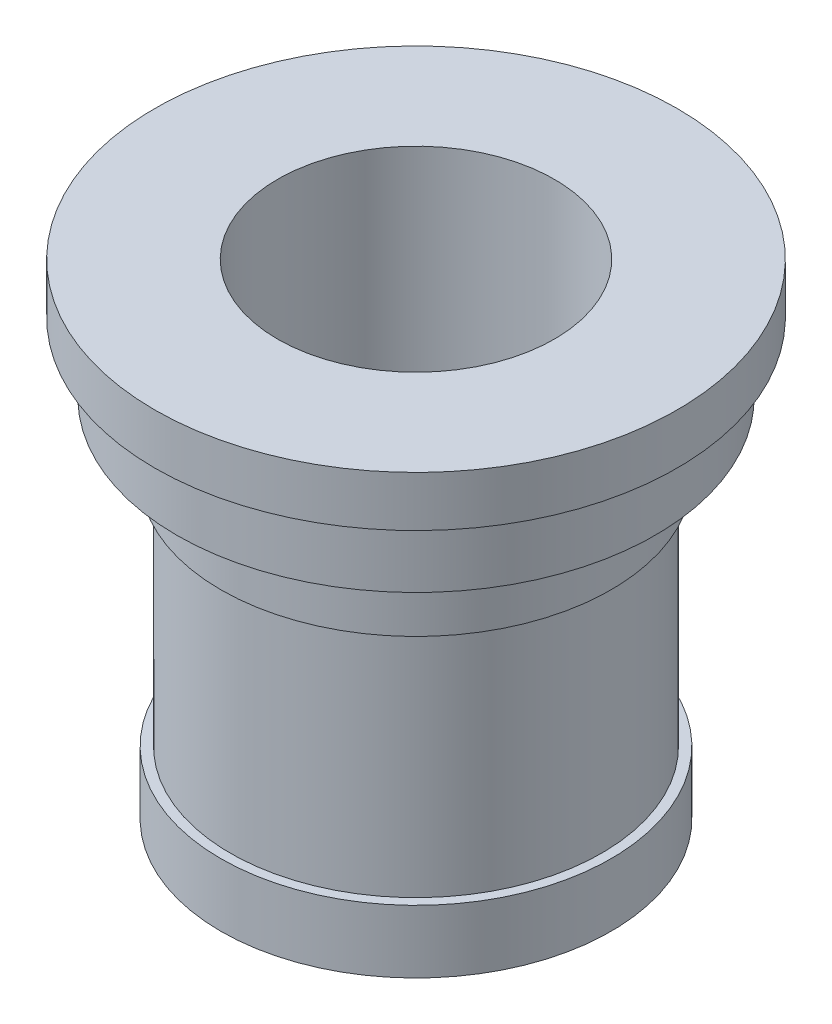
ISO-10303-21;
HEADER;
FILE_DESCRIPTION(('STEP AP214'),'2;1');
FILE_NAME('part.step','',(''),(''),'','','');
FILE_SCHEMA(('AUTOMOTIVE_DESIGN { 1 0 10303 214 1 1 1 1 }'));
ENDSEC;
DATA;
#1=APPLICATION_CONTEXT('core data for automotive mechanical design processes');
#2=APPLICATION_PROTOCOL_DEFINITION('international standard','automotive_design',2000,#1);
#3=PRODUCT_CONTEXT('',#1,'mechanical');
#4=PRODUCT('Part','Part','',(#3));
#5=PRODUCT_RELATED_PRODUCT_CATEGORY('part','',(#4));
#6=PRODUCT_DEFINITION_FORMATION('','',#4);
#7=PRODUCT_DEFINITION_CONTEXT('part definition',#1,'design');
#8=PRODUCT_DEFINITION('design','',#6,#7);
#9=PRODUCT_DEFINITION_SHAPE('','',#8);
#10=(LENGTH_UNIT() NAMED_UNIT(*) SI_UNIT(.MILLI.,.METRE.));
#11=(NAMED_UNIT(*) PLANE_ANGLE_UNIT() SI_UNIT($,.RADIAN.));
#12=(NAMED_UNIT(*) SI_UNIT($,.STERADIAN.) SOLID_ANGLE_UNIT());
#13=UNCERTAINTY_MEASURE_WITH_UNIT(LENGTH_MEASURE(1.E-05),#10,'distance_accuracy_value','');
#14=(GEOMETRIC_REPRESENTATION_CONTEXT(3) GLOBAL_UNCERTAINTY_ASSIGNED_CONTEXT((#13)) GLOBAL_UNIT_ASSIGNED_CONTEXT((#10,
#11,#12)) REPRESENTATION_CONTEXT('',''));
#15=CARTESIAN_POINT('',(0.,0.,0.));
#16=DIRECTION('',(0.,0.,1.));
#17=DIRECTION('',(1.,0.,0.));
#18=AXIS2_PLACEMENT_3D('',#15,#16,#17);
#19=CARTESIAN_POINT('',(0.,0.,0.));
#20=DIRECTION('',(0.,-1.,0.));
#21=DIRECTION('',(0.,0.,-1.));
#22=AXIS2_PLACEMENT_3D('',#19,#20,#21);
#23=PLANE('',#22);
#24=CARTESIAN_POINT('',(0.,0.,0.));
#25=DIRECTION('',(0.,1.,0.));
#26=DIRECTION('',(0.,0.,1.));
#27=AXIS2_PLACEMENT_3D('',#24,#25,#26);
#28=CIRCLE('',#27,22.);
#29=CARTESIAN_POINT('',(0.,0.,22.));
#30=VERTEX_POINT('',#29);
#31=EDGE_CURVE('E68',#30,#30,#28,.T.);
#32=ORIENTED_EDGE('',*,*,#31,.T.);
#33=EDGE_LOOP('',(#32));
#34=FACE_BOUND('',#33,.T.);
#35=CARTESIAN_POINT('',(0.,0.,0.));
#36=DIRECTION('',(0.,-1.,0.));
#37=DIRECTION('',(0.,0.,-1.));
#38=AXIS2_PLACEMENT_3D('',#35,#36,#37);
#39=CIRCLE('',#38,31.);
#40=CARTESIAN_POINT('',(0.,0.,-31.));
#41=VERTEX_POINT('',#40);
#42=EDGE_CURVE('E10',#41,#41,#39,.T.);
#43=ORIENTED_EDGE('',*,*,#42,.T.);
#44=EDGE_LOOP('',(#43));
#45=FACE_BOUND('',#44,.T.);
#46=ADVANCED_FACE('F31',(#34,#45),#23,.T.);
#47=CARTESIAN_POINT('',(0.,0.,0.));
#48=DIRECTION('',(0.,-1.,0.));
#49=DIRECTION('',(0.,0.,-1.));
#50=AXIS2_PLACEMENT_3D('',#47,#48,#49);
#51=CYLINDRICAL_SURFACE('',#50,31.);
#52=CARTESIAN_POINT('',(0.,10.,0.));
#53=DIRECTION('',(0.,-1.,0.));
#54=DIRECTION('',(0.,0.,-1.));
#55=AXIS2_PLACEMENT_3D('',#52,#53,#54);
#56=CIRCLE('',#55,31.);
#57=CARTESIAN_POINT('',(0.,10.,-31.));
#58=VERTEX_POINT('',#57);
#59=EDGE_CURVE('E37',#58,#58,#56,.T.);
#60=ORIENTED_EDGE('',*,*,#59,.T.);
#61=EDGE_LOOP('',(#60));
#62=FACE_BOUND('',#61,.T.);
#63=ORIENTED_EDGE('',*,*,#42,.F.);
#64=EDGE_LOOP('',(#63));
#65=FACE_BOUND('',#64,.T.);
#66=ADVANCED_FACE('F133',(#62,#65),#51,.T.);
#67=CARTESIAN_POINT('',(31.,10.,0.));
#68=DIRECTION('',(0.,1.,0.));
#69=DIRECTION('',(0.,0.,1.));
#70=AXIS2_PLACEMENT_3D('',#67,#68,#69);
#71=PLANE('',#70);
#72=CARTESIAN_POINT('',(0.,10.,0.));
#73=DIRECTION('',(0.,-1.,0.));
#74=DIRECTION('',(0.,0.,-1.));
#75=AXIS2_PLACEMENT_3D('',#72,#73,#74);
#76=CIRCLE('',#75,29.5);
#77=CARTESIAN_POINT('',(0.,10.,-29.5));
#78=VERTEX_POINT('',#77);
#79=EDGE_CURVE('E41',#78,#78,#76,.T.);
#80=ORIENTED_EDGE('',*,*,#79,.T.);
#81=EDGE_LOOP('',(#80));
#82=FACE_BOUND('',#81,.T.);
#83=ORIENTED_EDGE('',*,*,#59,.F.);
#84=EDGE_LOOP('',(#83));
#85=FACE_BOUND('',#84,.T.);
#86=ADVANCED_FACE('F127',(#82,#85),#71,.T.);
#87=CARTESIAN_POINT('',(0.,0.,0.));
#88=DIRECTION('',(0.,-1.,0.));
#89=DIRECTION('',(0.,0.,-1.));
#90=AXIS2_PLACEMENT_3D('',#87,#88,#89);
#91=CYLINDRICAL_SURFACE('',#90,29.5);
#92=CARTESIAN_POINT('',(0.,47.,0.));
#93=DIRECTION('',(0.,-1.,0.));
#94=DIRECTION('',(0.,0.,-1.));
#95=AXIS2_PLACEMENT_3D('',#92,#93,#94);
#96=CIRCLE('',#95,29.5);
#97=CARTESIAN_POINT('',(0.,47.,-29.5));
#98=VERTEX_POINT('',#97);
#99=EDGE_CURVE('E45',#98,#98,#96,.T.);
#100=ORIENTED_EDGE('',*,*,#99,.T.);
#101=EDGE_LOOP('',(#100));
#102=FACE_BOUND('',#101,.T.);
#103=ORIENTED_EDGE('',*,*,#79,.F.);
#104=EDGE_LOOP('',(#103));
#105=FACE_BOUND('',#104,.T.);
#106=ADVANCED_FACE('F121',(#102,#105),#91,.T.);
#107=CARTESIAN_POINT('',(29.5,47.,0.));
#108=DIRECTION('',(0.,-1.,0.));
#109=DIRECTION('',(0.,0.,-1.));
#110=AXIS2_PLACEMENT_3D('',#107,#108,#109);
#111=PLANE('',#110);
#112=CARTESIAN_POINT('',(0.,47.,0.));
#113=DIRECTION('',(0.,-1.,0.));
#114=DIRECTION('',(0.,0.,-1.));
#115=AXIS2_PLACEMENT_3D('',#112,#113,#114);
#116=CIRCLE('',#115,31.);
#117=CARTESIAN_POINT('',(0.,47.,-31.));
#118=VERTEX_POINT('',#117);
#119=EDGE_CURVE('E50',#118,#118,#116,.T.);
#120=ORIENTED_EDGE('',*,*,#119,.T.);
#121=EDGE_LOOP('',(#120));
#122=FACE_BOUND('',#121,.T.);
#123=ORIENTED_EDGE('',*,*,#99,.F.);
#124=EDGE_LOOP('',(#123));
#125=FACE_BOUND('',#124,.T.);
#126=ADVANCED_FACE('F115',(#122,#125),#111,.T.);
#127=CARTESIAN_POINT('',(0.,0.,0.));
#128=DIRECTION('',(0.,-1.,0.));
#129=DIRECTION('',(0.,0.,-1.));
#130=AXIS2_PLACEMENT_3D('',#127,#128,#129);
#131=CYLINDRICAL_SURFACE('',#130,31.);
#132=CARTESIAN_POINT('',(0.,58.,0.));
#133=DIRECTION('',(0.,-1.,0.));
#134=DIRECTION('',(0.,0.,-1.));
#135=AXIS2_PLACEMENT_3D('',#132,#133,#134);
#136=CIRCLE('',#135,31.);
#137=CARTESIAN_POINT('',(0.,58.,-31.));
#138=VERTEX_POINT('',#137);
#139=EDGE_CURVE('E53',#138,#138,#136,.T.);
#140=ORIENTED_EDGE('',*,*,#139,.T.);
#141=EDGE_LOOP('',(#140));
#142=FACE_BOUND('',#141,.T.);
#143=ORIENTED_EDGE('',*,*,#119,.F.);
#144=EDGE_LOOP('',(#143));
#145=FACE_BOUND('',#144,.T.);
#146=ADVANCED_FACE('F109',(#142,#145),#131,.T.);
#147=CARTESIAN_POINT('',(31.,58.,0.));
#148=DIRECTION('',(0.,-1.,0.));
#149=DIRECTION('',(0.,0.,-1.));
#150=AXIS2_PLACEMENT_3D('',#147,#148,#149);
#151=PLANE('',#150);
#152=CARTESIAN_POINT('',(0.,58.,0.));
#153=DIRECTION('',(0.,-1.,0.));
#154=DIRECTION('',(0.,0.,-1.));
#155=AXIS2_PLACEMENT_3D('',#152,#153,#154);
#156=CIRCLE('',#155,38.);
#157=CARTESIAN_POINT('',(0.,58.,-38.));
#158=VERTEX_POINT('',#157);
#159=EDGE_CURVE('E56',#158,#158,#156,.T.);
#160=ORIENTED_EDGE('',*,*,#159,.T.);
#161=EDGE_LOOP('',(#160));
#162=FACE_BOUND('',#161,.T.);
#163=ORIENTED_EDGE('',*,*,#139,.F.);
#164=EDGE_LOOP('',(#163));
#165=FACE_BOUND('',#164,.T.);
#166=ADVANCED_FACE('F103',(#162,#165),#151,.T.);
#167=CARTESIAN_POINT('',(0.,0.,0.));
#168=DIRECTION('',(0.,-1.,0.));
#169=DIRECTION('',(0.,0.,-1.));
#170=AXIS2_PLACEMENT_3D('',#167,#168,#169);
#171=CYLINDRICAL_SURFACE('',#170,38.);
#172=CARTESIAN_POINT('',(0.,69.,0.));
#173=DIRECTION('',(0.,-1.,0.));
#174=DIRECTION('',(0.,0.,-1.));
#175=AXIS2_PLACEMENT_3D('',#172,#173,#174);
#176=CIRCLE('',#175,38.);
#177=CARTESIAN_POINT('',(0.,69.,-38.));
#178=VERTEX_POINT('',#177);
#179=EDGE_CURVE('E59',#178,#178,#176,.T.);
#180=ORIENTED_EDGE('',*,*,#179,.T.);
#181=EDGE_LOOP('',(#180));
#182=FACE_BOUND('',#181,.T.);
#183=ORIENTED_EDGE('',*,*,#159,.F.);
#184=EDGE_LOOP('',(#183));
#185=FACE_BOUND('',#184,.T.);
#186=ADVANCED_FACE('F97',(#182,#185),#171,.T.);
#187=CARTESIAN_POINT('',(38.,69.,0.));
#188=DIRECTION('',(0.,-1.,0.));
#189=DIRECTION('',(0.,0.,-1.));
#190=AXIS2_PLACEMENT_3D('',#187,#188,#189);
#191=PLANE('',#190);
#192=CARTESIAN_POINT('',(0.,69.,0.));
#193=DIRECTION('',(0.,-1.,0.));
#194=DIRECTION('',(0.,0.,-1.));
#195=AXIS2_PLACEMENT_3D('',#192,#193,#194);
#196=CIRCLE('',#195,41.5);
#197=CARTESIAN_POINT('',(0.,69.,-41.5));
#198=VERTEX_POINT('',#197);
#199=EDGE_CURVE('E62',#198,#198,#196,.T.);
#200=ORIENTED_EDGE('',*,*,#199,.T.);
#201=EDGE_LOOP('',(#200));
#202=FACE_BOUND('',#201,.T.);
#203=ORIENTED_EDGE('',*,*,#179,.F.);
#204=EDGE_LOOP('',(#203));
#205=FACE_BOUND('',#204,.T.);
#206=ADVANCED_FACE('F91',(#202,#205),#191,.T.);
#207=CARTESIAN_POINT('',(0.,0.,0.));
#208=DIRECTION('',(0.,-1.,0.));
#209=DIRECTION('',(0.,0.,-1.));
#210=AXIS2_PLACEMENT_3D('',#207,#208,#209);
#211=CYLINDRICAL_SURFACE('',#210,41.5);
#212=CARTESIAN_POINT('',(0.,77.,0.));
#213=DIRECTION('',(0.,-1.,0.));
#214=DIRECTION('',(0.,0.,-1.));
#215=AXIS2_PLACEMENT_3D('',#212,#213,#214);
#216=CIRCLE('',#215,41.5);
#217=CARTESIAN_POINT('',(0.,77.,-41.5));
#218=VERTEX_POINT('',#217);
#219=EDGE_CURVE('E65',#218,#218,#216,.T.);
#220=ORIENTED_EDGE('',*,*,#219,.T.);
#221=EDGE_LOOP('',(#220));
#222=FACE_BOUND('',#221,.T.);
#223=ORIENTED_EDGE('',*,*,#199,.F.);
#224=EDGE_LOOP('',(#223));
#225=FACE_BOUND('',#224,.T.);
#226=ADVANCED_FACE('F85',(#222,#225),#211,.T.);
#227=CARTESIAN_POINT('',(41.5,77.,0.));
#228=DIRECTION('',(0.,1.,0.));
#229=DIRECTION('',(0.,0.,1.));
#230=AXIS2_PLACEMENT_3D('',#227,#228,#229);
#231=PLANE('',#230);
#232=CARTESIAN_POINT('',(0.,77.,0.));
#233=DIRECTION('',(0.,1.,0.));
#234=DIRECTION('',(0.,0.,1.));
#235=AXIS2_PLACEMENT_3D('',#232,#233,#234);
#236=CIRCLE('',#235,22.);
#237=CARTESIAN_POINT('',(0.,77.,22.));
#238=VERTEX_POINT('',#237);
#239=EDGE_CURVE('E69',#238,#238,#236,.T.);
#240=ORIENTED_EDGE('',*,*,#239,.F.);
#241=EDGE_LOOP('',(#240));
#242=FACE_BOUND('',#241,.T.);
#243=ORIENTED_EDGE('',*,*,#219,.F.);
#244=EDGE_LOOP('',(#243));
#245=FACE_BOUND('',#244,.T.);
#246=ADVANCED_FACE('F79',(#242,#245),#231,.T.);
#247=CARTESIAN_POINT('',(0.,0.,0.));
#248=DIRECTION('',(0.,1.,0.));
#249=DIRECTION('',(0.,0.,1.));
#250=AXIS2_PLACEMENT_3D('',#247,#248,#249);
#251=CYLINDRICAL_SURFACE('',#250,22.);
#252=ORIENTED_EDGE('',*,*,#31,.F.);
#253=EDGE_LOOP('',(#252));
#254=FACE_BOUND('',#253,.T.);
#255=ORIENTED_EDGE('',*,*,#239,.T.);
#256=EDGE_LOOP('',(#255));
#257=FACE_BOUND('',#256,.T.);
#258=ADVANCED_FACE('F76',(#254,#257),#251,.F.);
#259=CLOSED_SHELL('',(#46,#66,#86,#106,#126,#146,#166,#186,#206,#226,#246,#258));
#260=MANIFOLD_SOLID_BREP('B2',#259);
#261=ADVANCED_BREP_SHAPE_REPRESENTATION('',(#18,#260),#14);
#262=SHAPE_DEFINITION_REPRESENTATION(#9,#261);
ENDSEC;
END-ISO-10303-21;
